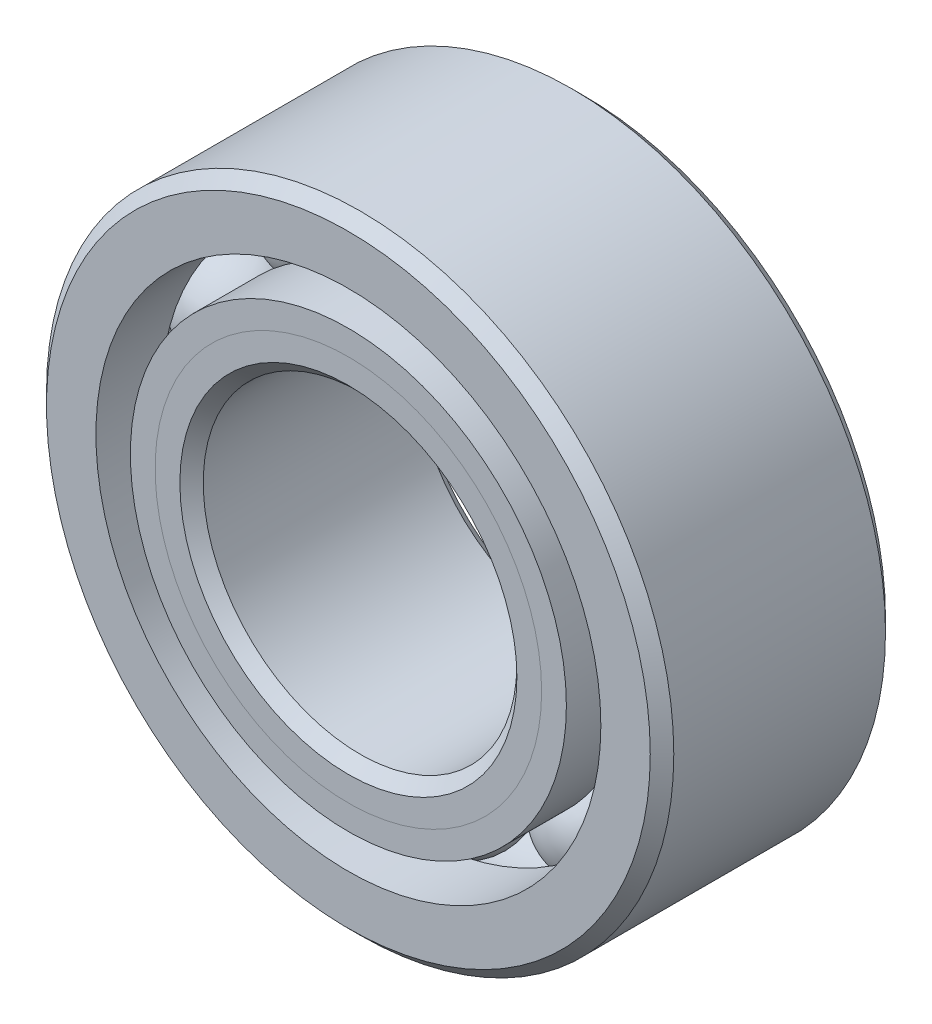
ISO-10303-21;
HEADER;
FILE_DESCRIPTION(('STEP AP214'),'2;1');
FILE_NAME('part.step','',(''),(''),'','','');
FILE_SCHEMA(('AUTOMOTIVE_DESIGN { 1 0 10303 214 1 1 1 1 }'));
ENDSEC;
DATA;
#1=APPLICATION_CONTEXT('core data for automotive mechanical design processes');
#2=APPLICATION_PROTOCOL_DEFINITION('international standard','automotive_design',2000,#1);
#3=PRODUCT_CONTEXT('',#1,'mechanical');
#4=PRODUCT('Part','Part','',(#3));
#5=PRODUCT_RELATED_PRODUCT_CATEGORY('part','',(#4));
#6=PRODUCT_DEFINITION_FORMATION('','',#4);
#7=PRODUCT_DEFINITION_CONTEXT('part definition',#1,'design');
#8=PRODUCT_DEFINITION('design','',#6,#7);
#9=PRODUCT_DEFINITION_SHAPE('','',#8);
#10=(LENGTH_UNIT() NAMED_UNIT(*) SI_UNIT(.MILLI.,.METRE.));
#11=(NAMED_UNIT(*) PLANE_ANGLE_UNIT() SI_UNIT($,.RADIAN.));
#12=(NAMED_UNIT(*) SI_UNIT($,.STERADIAN.) SOLID_ANGLE_UNIT());
#13=UNCERTAINTY_MEASURE_WITH_UNIT(LENGTH_MEASURE(1.E-05),#10,'distance_accuracy_value','');
#14=(GEOMETRIC_REPRESENTATION_CONTEXT(3) GLOBAL_UNCERTAINTY_ASSIGNED_CONTEXT((#13)) GLOBAL_UNIT_ASSIGNED_CONTEXT((#10,
#11,#12)) REPRESENTATION_CONTEXT('',''));
#15=CARTESIAN_POINT('',(0.,0.,0.));
#16=DIRECTION('',(0.,0.,1.));
#17=DIRECTION('',(1.,0.,0.));
#18=AXIS2_PLACEMENT_3D('',#15,#16,#17);
#19=CARTESIAN_POINT('',(-1.39966363202143,1.92647171785536,0.));
#20=DIRECTION('',(0.,0.,1.));
#21=DIRECTION('',(-0.587785252292462,0.809016994374955,0.));
#22=AXIS2_PLACEMENT_3D('',#19,#20,#21);
#23=SPHERICAL_SURFACE('',#22,0.557180720515983);
#24=CARTESIAN_POINT('',(-1.39966363202143,1.92647171785536,0.557180720515983));
#25=VERTEX_POINT('',#24);
#26=VERTEX_LOOP('',#25);
#27=FACE_BOUND('',#26,.T.);
#28=ADVANCED_FACE('F37',(#27),#23,.T.);
#29=CLOSED_SHELL('',(#28));
#30=MANIFOLD_SOLID_BREP('B2',#29);
#31=CARTESIAN_POINT('',(-2.26470332942783,0.735846717855369,0.));
#32=DIRECTION('',(0.,0.,1.));
#33=DIRECTION('',(-0.95105651629515,0.309016994374958,0.));
#34=AXIS2_PLACEMENT_3D('',#31,#32,#33);
#35=SPHERICAL_SURFACE('',#34,0.557180720515983);
#36=CARTESIAN_POINT('',(-2.26470332942783,0.735846717855369,0.557180720515983));
#37=VERTEX_POINT('',#36);
#38=VERTEX_LOOP('',#37);
#39=FACE_BOUND('',#38,.T.);
#40=ADVANCED_FACE('F68',(#39),#35,.T.);
#41=CLOSED_SHELL('',(#40));
#42=MANIFOLD_SOLID_BREP('B6',#41);
#43=CARTESIAN_POINT('',(-2.26470332942784,-0.735846717855322,0.));
#44=DIRECTION('',(0.,0.,1.));
#45=DIRECTION('',(-0.951056516295157,-0.309016994374938,0.));
#46=AXIS2_PLACEMENT_3D('',#43,#44,#45);
#47=SPHERICAL_SURFACE('',#46,0.557180720515983);
#48=CARTESIAN_POINT('',(-2.26470332942784,-0.735846717855322,0.557180720515983));
#49=VERTEX_POINT('',#48);
#50=VERTEX_LOOP('',#49);
#51=FACE_BOUND('',#50,.T.);
#52=ADVANCED_FACE('F99',(#51),#47,.T.);
#53=CLOSED_SHELL('',(#52));
#54=MANIFOLD_SOLID_BREP('B33',#53);
#55=CARTESIAN_POINT('',(-1.39966363202147,-1.92647171785533,0.));
#56=DIRECTION('',(0.,0.,1.));
#57=DIRECTION('',(-0.58778525229248,-0.809016994374942,0.));
#58=AXIS2_PLACEMENT_3D('',#55,#56,#57);
#59=SPHERICAL_SURFACE('',#58,0.557180720515983);
#60=CARTESIAN_POINT('',(-1.39966363202147,-1.92647171785533,0.557180720515983));
#61=VERTEX_POINT('',#60);
#62=VERTEX_LOOP('',#61);
#63=FACE_BOUND('',#62,.T.);
#64=ADVANCED_FACE('F130',(#63),#59,.T.);
#65=CLOSED_SHELL('',(#64));
#66=MANIFOLD_SOLID_BREP('B64',#65);
#67=CARTESIAN_POINT('',(0.,-2.38125,0.));
#68=DIRECTION('',(0.,0.,1.));
#69=DIRECTION('',(0.,-1.,0.));
#70=AXIS2_PLACEMENT_3D('',#67,#68,#69);
#71=SPHERICAL_SURFACE('',#70,0.557180720515983);
#72=CARTESIAN_POINT('',(0.,-2.38125,0.557180720515983));
#73=VERTEX_POINT('',#72);
#74=VERTEX_LOOP('',#73);
#75=FACE_BOUND('',#74,.T.);
#76=ADVANCED_FACE('F161',(#75),#71,.T.);
#77=CLOSED_SHELL('',(#76));
#78=MANIFOLD_SOLID_BREP('B95',#77);
#79=CARTESIAN_POINT('',(1.39966363202144,-1.92647171785535,0.));
#80=DIRECTION('',(0.,0.,1.));
#81=DIRECTION('',(0.587785252292469,-0.809016994374951,0.));
#82=AXIS2_PLACEMENT_3D('',#79,#80,#81);
#83=SPHERICAL_SURFACE('',#82,0.557180720515983);
#84=CARTESIAN_POINT('',(1.39966363202144,-1.92647171785535,0.557180720515983));
#85=VERTEX_POINT('',#84);
#86=VERTEX_LOOP('',#85);
#87=FACE_BOUND('',#86,.T.);
#88=ADVANCED_FACE('F192',(#87),#83,.T.);
#89=CLOSED_SHELL('',(#88));
#90=MANIFOLD_SOLID_BREP('B126',#89);
#91=CARTESIAN_POINT('',(2.26470332942783,-0.735846717855353,0.));
#92=DIRECTION('',(0.,0.,1.));
#93=DIRECTION('',(0.951056516295152,-0.309016994374952,0.));
#94=AXIS2_PLACEMENT_3D('',#91,#92,#93);
#95=SPHERICAL_SURFACE('',#94,0.557180720515983);
#96=CARTESIAN_POINT('',(2.26470332942783,-0.735846717855353,0.557180720515983));
#97=VERTEX_POINT('',#96);
#98=VERTEX_LOOP('',#97);
#99=FACE_BOUND('',#98,.T.);
#100=ADVANCED_FACE('F223',(#99),#95,.T.);
#101=CLOSED_SHELL('',(#100));
#102=MANIFOLD_SOLID_BREP('B157',#101);
#103=CARTESIAN_POINT('',(2.26470332942784,0.735846717855337,0.));
#104=DIRECTION('',(0.,0.,1.));
#105=DIRECTION('',(0.951056516295155,0.309016994374945,0.));
#106=AXIS2_PLACEMENT_3D('',#103,#104,#105);
#107=SPHERICAL_SURFACE('',#106,0.557180720515983);
#108=CARTESIAN_POINT('',(2.26470332942784,0.735846717855337,0.557180720515983));
#109=VERTEX_POINT('',#108);
#110=VERTEX_LOOP('',#109);
#111=FACE_BOUND('',#110,.T.);
#112=ADVANCED_FACE('F254',(#111),#107,.T.);
#113=CLOSED_SHELL('',(#112));
#114=MANIFOLD_SOLID_BREP('B188',#113);
#115=CARTESIAN_POINT('',(1.39966363202145,1.92647171785534,0.));
#116=DIRECTION('',(0.,0.,1.));
#117=DIRECTION('',(0.587785252292474,0.809016994374947,0.));
#118=AXIS2_PLACEMENT_3D('',#115,#116,#117);
#119=SPHERICAL_SURFACE('',#118,0.557180720515983);
#120=CARTESIAN_POINT('',(1.39966363202145,1.92647171785534,0.557180720515983));
#121=VERTEX_POINT('',#120);
#122=VERTEX_LOOP('',#121);
#123=FACE_BOUND('',#122,.T.);
#124=ADVANCED_FACE('F285',(#123),#119,.T.);
#125=CLOSED_SHELL('',(#124));
#126=MANIFOLD_SOLID_BREP('B219',#125);
#127=CARTESIAN_POINT('',(0.,2.38125,0.));
#128=DIRECTION('',(0.,0.,1.));
#129=DIRECTION('',(0.,1.,0.));
#130=AXIS2_PLACEMENT_3D('',#127,#128,#129);
#131=SPHERICAL_SURFACE('',#130,0.557180720515983);
#132=CARTESIAN_POINT('',(0.,2.38125,0.557180720515983));
#133=VERTEX_POINT('',#132);
#134=VERTEX_LOOP('',#133);
#135=FACE_BOUND('',#134,.T.);
#136=ADVANCED_FACE('F318',(#135),#131,.T.);
#137=CLOSED_SHELL('',(#136));
#138=MANIFOLD_SOLID_BREP('B250',#137);
#139=CARTESIAN_POINT('',(0.,1.95629204514573,1.190625));
#140=DIRECTION('',(0.,0.,-1.));
#141=DIRECTION('',(-1.,0.,0.));
#142=AXIS2_PLACEMENT_3D('',#139,#140,#141);
#143=PLANE('',#142);
#144=CARTESIAN_POINT('',(0.,0.,1.190625));
#145=DIRECTION('',(0.,0.,1.));
#146=DIRECTION('',(1.,0.,0.));
#147=AXIS2_PLACEMENT_3D('',#144,#145,#146);
#148=CIRCLE('',#147,1.70578463974201);
#149=CARTESIAN_POINT('',(1.70578463974201,0.,1.190625));
#150=VERTEX_POINT('',#149);
#151=EDGE_CURVE('E372',#150,#150,#148,.T.);
#152=ORIENTED_EDGE('',*,*,#151,.F.);
#153=EDGE_LOOP('',(#152));
#154=FACE_BOUND('',#153,.T.);
#155=CARTESIAN_POINT('',(0.,0.,1.190625));
#156=DIRECTION('',(0.,0.,1.));
#157=DIRECTION('',(1.,0.,0.));
#158=AXIS2_PLACEMENT_3D('',#155,#156,#157);
#159=CIRCLE('',#158,1.95629204514573);
#160=CARTESIAN_POINT('',(1.95629204514573,0.,1.190625));
#161=VERTEX_POINT('',#160);
#162=EDGE_CURVE('E317',#161,#161,#159,.T.);
#163=ORIENTED_EDGE('',*,*,#162,.T.);
#164=EDGE_LOOP('',(#163));
#165=FACE_BOUND('',#164,.T.);
#166=ADVANCED_FACE('F338',(#154,#165),#143,.F.);
#167=CARTESIAN_POINT('',(0.,0.,0.94011759459628));
#168=DIRECTION('',(0.,0.,1.));
#169=DIRECTION('',(1.,0.,0.));
#170=AXIS2_PLACEMENT_3D('',#167,#168,#169);
#171=CONICAL_SURFACE('',#170,1.70578463974201,0.78539816339745);
#172=ORIENTED_EDGE('',*,*,#162,.F.);
#173=EDGE_LOOP('',(#172));
#174=FACE_BOUND('',#173,.T.);
#175=CARTESIAN_POINT('',(0.,0.,0.94011759459628));
#176=DIRECTION('',(0.,0.,1.));
#177=DIRECTION('',(1.,0.,0.));
#178=AXIS2_PLACEMENT_3D('',#175,#176,#177);
#179=CIRCLE('',#178,1.70578463974201);
#180=CARTESIAN_POINT('',(1.70578463974201,0.,0.94011759459628));
#181=VERTEX_POINT('',#180);
#182=EDGE_CURVE('E344',#181,#181,#179,.T.);
#183=ORIENTED_EDGE('',*,*,#182,.T.);
#184=EDGE_LOOP('',(#183));
#185=FACE_BOUND('',#184,.T.);
#186=ADVANCED_FACE('F379',(#174,#185),#171,.T.);
#187=CARTESIAN_POINT('',(0.,0.,1.190625));
#188=DIRECTION('',(0.,0.,1.));
#189=DIRECTION('',(1.,0.,0.));
#190=AXIS2_PLACEMENT_3D('',#187,#188,#189);
#191=CYLINDRICAL_SURFACE('',#190,1.70578463974201);
#192=ORIENTED_EDGE('',*,*,#182,.F.);
#193=EDGE_LOOP('',(#192));
#194=FACE_BOUND('',#193,.T.);
#195=CARTESIAN_POINT('',(0.,0.,0.));
#196=DIRECTION('',(0.,0.,1.));
#197=DIRECTION('',(1.,0.,0.));
#198=AXIS2_PLACEMENT_3D('',#195,#196,#197);
#199=CIRCLE('',#198,1.70578463974201);
#200=CARTESIAN_POINT('',(1.70578463974201,0.,0.));
#201=VERTEX_POINT('',#200);
#202=EDGE_CURVE('E348',#201,#201,#199,.T.);
#203=ORIENTED_EDGE('',*,*,#202,.T.);
#204=EDGE_LOOP('',(#203));
#205=FACE_BOUND('',#204,.T.);
#206=ADVANCED_FACE('F383',(#194,#205),#191,.T.);
#207=CARTESIAN_POINT('',(0.,1.70578463974201,0.));
#208=DIRECTION('',(0.,0.,-1.));
#209=DIRECTION('',(-1.,0.,0.));
#210=AXIS2_PLACEMENT_3D('',#207,#208,#209);
#211=PLANE('',#210);
#212=ORIENTED_EDGE('',*,*,#202,.F.);
#213=EDGE_LOOP('',(#212));
#214=FACE_BOUND('',#213,.T.);
#215=CARTESIAN_POINT('',(0.,0.,0.));
#216=DIRECTION('',(0.,0.,1.));
#217=DIRECTION('',(1.,0.,0.));
#218=AXIS2_PLACEMENT_3D('',#215,#216,#217);
#219=CIRCLE('',#218,1.82406927948402);
#220=CARTESIAN_POINT('',(1.82406927948402,0.,0.));
#221=VERTEX_POINT('',#220);
#222=EDGE_CURVE('E352',#221,#221,#219,.T.);
#223=ORIENTED_EDGE('',*,*,#222,.T.);
#224=EDGE_LOOP('',(#223));
#225=FACE_BOUND('',#224,.T.);
#226=ADVANCED_FACE('F388',(#214,#225),#211,.F.);
#227=CARTESIAN_POINT('',(0.,0.,0.));
#228=DIRECTION('',(0.,0.,1.));
#229=DIRECTION('',(1.,0.,0.));
#230=AXIS2_PLACEMENT_3D('',#227,#228,#229);
#231=TOROIDAL_SURFACE('',#230,2.38125,0.557180720515983);
#232=ORIENTED_EDGE('',*,*,#222,.F.);
#233=EDGE_LOOP('',(#232));
#234=FACE_BOUND('',#233,.T.);
#235=CARTESIAN_POINT('',(0.,0.,-0.529166666666667));
#236=DIRECTION('',(0.,0.,1.));
#237=DIRECTION('',(1.,0.,0.));
#238=AXIS2_PLACEMENT_3D('',#235,#236,#237);
#239=CIRCLE('',#238,2.20679945054945);
#240=CARTESIAN_POINT('',(2.20679945054945,0.,-0.529166666666667));
#241=VERTEX_POINT('',#240);
#242=EDGE_CURVE('E357',#241,#241,#239,.T.);
#243=ORIENTED_EDGE('',*,*,#242,.T.);
#244=EDGE_LOOP('',(#243));
#245=FACE_BOUND('',#244,.T.);
#246=ADVANCED_FACE('F394',(#234,#245),#231,.F.);
#247=CARTESIAN_POINT('',(0.,0.,1.190625));
#248=DIRECTION('',(0.,0.,1.));
#249=DIRECTION('',(1.,0.,0.));
#250=AXIS2_PLACEMENT_3D('',#247,#248,#249);
#251=CYLINDRICAL_SURFACE('',#250,2.20679945054945);
#252=ORIENTED_EDGE('',*,*,#242,.F.);
#253=EDGE_LOOP('',(#252));
#254=FACE_BOUND('',#253,.T.);
#255=CARTESIAN_POINT('',(0.,0.,-1.190625));
#256=DIRECTION('',(0.,0.,1.));
#257=DIRECTION('',(1.,0.,0.));
#258=AXIS2_PLACEMENT_3D('',#255,#256,#257);
#259=CIRCLE('',#258,2.20679945054945);
#260=CARTESIAN_POINT('',(2.20679945054945,0.,-1.190625));
#261=VERTEX_POINT('',#260);
#262=EDGE_CURVE('E360',#261,#261,#259,.T.);
#263=ORIENTED_EDGE('',*,*,#262,.T.);
#264=EDGE_LOOP('',(#263));
#265=FACE_BOUND('',#264,.T.);
#266=ADVANCED_FACE('F398',(#254,#265),#251,.T.);
#267=CARTESIAN_POINT('',(0.,1.7065625,-1.190625));
#268=DIRECTION('',(0.,0.,1.));
#269=DIRECTION('',(1.,0.,0.));
#270=AXIS2_PLACEMENT_3D('',#267,#268,#269);
#271=PLANE('',#270);
#272=ORIENTED_EDGE('',*,*,#262,.F.);
#273=EDGE_LOOP('',(#272));
#274=FACE_BOUND('',#273,.T.);
#275=CARTESIAN_POINT('',(0.,0.,-1.190625));
#276=DIRECTION('',(0.,0.,1.));
#277=DIRECTION('',(1.,0.,0.));
#278=AXIS2_PLACEMENT_3D('',#275,#276,#277);
#279=CIRCLE('',#278,1.7065625);
#280=CARTESIAN_POINT('',(1.7065625,0.,-1.190625));
#281=VERTEX_POINT('',#280);
#282=EDGE_CURVE('E363',#281,#281,#279,.T.);
#283=ORIENTED_EDGE('',*,*,#282,.T.);
#284=EDGE_LOOP('',(#283));
#285=FACE_BOUND('',#284,.T.);
#286=ADVANCED_FACE('F402',(#274,#285),#271,.F.);
#287=CARTESIAN_POINT('',(0.,0.,-1.0715625));
#288=DIRECTION('',(0.,0.,-1.));
#289=DIRECTION('',(-1.,0.,0.));
#290=AXIS2_PLACEMENT_3D('',#287,#288,#289);
#291=CONICAL_SURFACE('',#290,1.5875,0.785398163397447);
#292=ORIENTED_EDGE('',*,*,#282,.F.);
#293=EDGE_LOOP('',(#292));
#294=FACE_BOUND('',#293,.T.);
#295=CARTESIAN_POINT('',(0.,0.,-1.0715625));
#296=DIRECTION('',(0.,0.,1.));
#297=DIRECTION('',(1.,0.,0.));
#298=AXIS2_PLACEMENT_3D('',#295,#296,#297);
#299=CIRCLE('',#298,1.5875);
#300=CARTESIAN_POINT('',(1.5875,0.,-1.0715625));
#301=VERTEX_POINT('',#300);
#302=EDGE_CURVE('E366',#301,#301,#299,.T.);
#303=ORIENTED_EDGE('',*,*,#302,.T.);
#304=EDGE_LOOP('',(#303));
#305=FACE_BOUND('',#304,.T.);
#306=ADVANCED_FACE('F406',(#294,#305),#291,.F.);
#307=CARTESIAN_POINT('',(0.,0.,1.190625));
#308=DIRECTION('',(0.,0.,1.));
#309=DIRECTION('',(1.,0.,0.));
#310=AXIS2_PLACEMENT_3D('',#307,#308,#309);
#311=CYLINDRICAL_SURFACE('',#310,1.5875);
#312=ORIENTED_EDGE('',*,*,#302,.F.);
#313=EDGE_LOOP('',(#312));
#314=FACE_BOUND('',#313,.T.);
#315=CARTESIAN_POINT('',(0.,0.,1.07234036025799));
#316=DIRECTION('',(0.,0.,1.));
#317=DIRECTION('',(1.,0.,0.));
#318=AXIS2_PLACEMENT_3D('',#315,#316,#317);
#319=CIRCLE('',#318,1.5875);
#320=CARTESIAN_POINT('',(1.5875,0.,1.07234036025799));
#321=VERTEX_POINT('',#320);
#322=EDGE_CURVE('E369',#321,#321,#319,.T.);
#323=ORIENTED_EDGE('',*,*,#322,.T.);
#324=EDGE_LOOP('',(#323));
#325=FACE_BOUND('',#324,.T.);
#326=ADVANCED_FACE('F410',(#314,#325),#311,.F.);
#327=CARTESIAN_POINT('',(0.,0.,1.190625));
#328=DIRECTION('',(0.,0.,1.));
#329=DIRECTION('',(1.,0.,0.));
#330=AXIS2_PLACEMENT_3D('',#327,#328,#329);
#331=CONICAL_SURFACE('',#330,1.70578463974201,0.78539816339745);
#332=ORIENTED_EDGE('',*,*,#322,.F.);
#333=EDGE_LOOP('',(#332));
#334=FACE_BOUND('',#333,.T.);
#335=ORIENTED_EDGE('',*,*,#151,.T.);
#336=EDGE_LOOP('',(#335));
#337=FACE_BOUND('',#336,.T.);
#338=ADVANCED_FACE('F376',(#334,#337),#331,.F.);
#339=CLOSED_SHELL('',(#166,#186,#206,#226,#246,#266,#286,#306,#326,#338));
#340=MANIFOLD_SOLID_BREP('B281',#339);
#341=CARTESIAN_POINT('',(0.,2.20679945054945,1.190625));
#342=DIRECTION('',(0.,0.,-1.));
#343=DIRECTION('',(-1.,0.,0.));
#344=AXIS2_PLACEMENT_3D('',#341,#342,#343);
#345=PLANE('',#344);
#346=CARTESIAN_POINT('',(0.,0.,1.190625));
#347=DIRECTION('',(0.,0.,1.));
#348=DIRECTION('',(1.,0.,0.));
#349=AXIS2_PLACEMENT_3D('',#346,#347,#348);
#350=CIRCLE('',#349,1.95629204514573);
#351=CARTESIAN_POINT('',(1.95629204514573,0.,1.190625));
#352=VERTEX_POINT('',#351);
#353=EDGE_CURVE('E337',#352,#352,#350,.T.);
#354=ORIENTED_EDGE('',*,*,#353,.F.);
#355=EDGE_LOOP('',(#354));
#356=FACE_BOUND('',#355,.T.);
#357=CARTESIAN_POINT('',(0.,0.,1.190625));
#358=DIRECTION('',(0.,0.,1.));
#359=DIRECTION('',(1.,0.,0.));
#360=AXIS2_PLACEMENT_3D('',#357,#358,#359);
#361=CIRCLE('',#360,2.20679945054945);
#362=CARTESIAN_POINT('',(2.20679945054945,0.,1.190625));
#363=VERTEX_POINT('',#362);
#364=EDGE_CURVE('E518',#363,#363,#361,.T.);
#365=ORIENTED_EDGE('',*,*,#364,.T.);
#366=EDGE_LOOP('',(#365));
#367=FACE_BOUND('',#366,.T.);
#368=ADVANCED_FACE('F496',(#356,#367),#345,.F.);
#369=CARTESIAN_POINT('',(0.,0.,1.190625));
#370=DIRECTION('',(0.,0.,1.));
#371=DIRECTION('',(1.,0.,0.));
#372=AXIS2_PLACEMENT_3D('',#369,#370,#371);
#373=CONICAL_SURFACE('',#372,1.95629204514573,0.78539816339745);
#374=CARTESIAN_POINT('',(0.,0.,0.94011759459628));
#375=DIRECTION('',(0.,0.,1.));
#376=DIRECTION('',(1.,0.,0.));
#377=AXIS2_PLACEMENT_3D('',#374,#375,#376);
#378=CIRCLE('',#377,1.70578463974201);
#379=CARTESIAN_POINT('',(1.70578463974201,0.,0.94011759459628));
#380=VERTEX_POINT('',#379);
#381=EDGE_CURVE('E502',#380,#380,#378,.T.);
#382=ORIENTED_EDGE('',*,*,#381,.F.);
#383=EDGE_LOOP('',(#382));
#384=FACE_BOUND('',#383,.T.);
#385=ORIENTED_EDGE('',*,*,#353,.T.);
#386=EDGE_LOOP('',(#385));
#387=FACE_BOUND('',#386,.T.);
#388=ADVANCED_FACE('F543',(#384,#387),#373,.F.);
#389=CARTESIAN_POINT('',(0.,0.,1.190625));
#390=DIRECTION('',(0.,0.,1.));
#391=DIRECTION('',(1.,0.,0.));
#392=AXIS2_PLACEMENT_3D('',#389,#390,#391);
#393=CYLINDRICAL_SURFACE('',#392,1.70578463974201);
#394=CARTESIAN_POINT('',(0.,0.,0.));
#395=DIRECTION('',(0.,0.,1.));
#396=DIRECTION('',(1.,0.,0.));
#397=AXIS2_PLACEMENT_3D('',#394,#395,#396);
#398=CIRCLE('',#397,1.70578463974201);
#399=CARTESIAN_POINT('',(1.70578463974201,0.,0.));
#400=VERTEX_POINT('',#399);
#401=EDGE_CURVE('E506',#400,#400,#398,.T.);
#402=ORIENTED_EDGE('',*,*,#401,.F.);
#403=EDGE_LOOP('',(#402));
#404=FACE_BOUND('',#403,.T.);
#405=ORIENTED_EDGE('',*,*,#381,.T.);
#406=EDGE_LOOP('',(#405));
#407=FACE_BOUND('',#406,.T.);
#408=ADVANCED_FACE('F538',(#404,#407),#393,.F.);
#409=CARTESIAN_POINT('',(0.,1.70578463974201,0.));
#410=DIRECTION('',(0.,0.,1.));
#411=DIRECTION('',(1.,0.,0.));
#412=AXIS2_PLACEMENT_3D('',#409,#410,#411);
#413=PLANE('',#412);
#414=CARTESIAN_POINT('',(0.,0.,0.));
#415=DIRECTION('',(0.,0.,1.));
#416=DIRECTION('',(1.,0.,0.));
#417=AXIS2_PLACEMENT_3D('',#414,#415,#416);
#418=CIRCLE('',#417,1.82406927948402);
#419=CARTESIAN_POINT('',(1.82406927948402,0.,0.));
#420=VERTEX_POINT('',#419);
#421=EDGE_CURVE('E510',#420,#420,#418,.T.);
#422=ORIENTED_EDGE('',*,*,#421,.F.);
#423=EDGE_LOOP('',(#422));
#424=FACE_BOUND('',#423,.T.);
#425=ORIENTED_EDGE('',*,*,#401,.T.);
#426=EDGE_LOOP('',(#425));
#427=FACE_BOUND('',#426,.T.);
#428=ADVANCED_FACE('F532',(#424,#427),#413,.F.);
#429=CARTESIAN_POINT('',(0.,0.,0.));
#430=DIRECTION('',(0.,0.,1.));
#431=DIRECTION('',(1.,0.,0.));
#432=AXIS2_PLACEMENT_3D('',#429,#430,#431);
#433=TOROIDAL_SURFACE('',#432,2.38125,0.557180720515983);
#434=CARTESIAN_POINT('',(0.,0.,0.529166666666667));
#435=DIRECTION('',(0.,0.,1.));
#436=DIRECTION('',(1.,0.,0.));
#437=AXIS2_PLACEMENT_3D('',#434,#435,#436);
#438=CIRCLE('',#437,2.20679945054945);
#439=CARTESIAN_POINT('',(2.20679945054945,0.,0.529166666666667));
#440=VERTEX_POINT('',#439);
#441=EDGE_CURVE('E515',#440,#440,#438,.T.);
#442=ORIENTED_EDGE('',*,*,#441,.F.);
#443=EDGE_LOOP('',(#442));
#444=FACE_BOUND('',#443,.T.);
#445=ORIENTED_EDGE('',*,*,#421,.T.);
#446=EDGE_LOOP('',(#445));
#447=FACE_BOUND('',#446,.T.);
#448=ADVANCED_FACE('F526',(#444,#447),#433,.F.);
#449=CARTESIAN_POINT('',(0.,0.,1.190625));
#450=DIRECTION('',(0.,0.,1.));
#451=DIRECTION('',(1.,0.,0.));
#452=AXIS2_PLACEMENT_3D('',#449,#450,#451);
#453=CYLINDRICAL_SURFACE('',#452,2.20679945054945);
#454=ORIENTED_EDGE('',*,*,#364,.F.);
#455=EDGE_LOOP('',(#454));
#456=FACE_BOUND('',#455,.T.);
#457=ORIENTED_EDGE('',*,*,#441,.T.);
#458=EDGE_LOOP('',(#457));
#459=FACE_BOUND('',#458,.T.);
#460=ADVANCED_FACE('F523',(#456,#459),#453,.T.);
#461=CLOSED_SHELL('',(#368,#388,#408,#428,#448,#460));
#462=MANIFOLD_SOLID_BREP('B312',#461);
#463=CARTESIAN_POINT('',(0.,0.,1.0715625));
#464=DIRECTION('',(0.,0.,-1.));
#465=DIRECTION('',(-1.,0.,0.));
#466=AXIS2_PLACEMENT_3D('',#463,#464,#465);
#467=CONICAL_SURFACE('',#466,3.175,0.785398163397449);
#468=CARTESIAN_POINT('',(0.,0.,1.190625));
#469=DIRECTION('',(0.,0.,1.));
#470=DIRECTION('',(1.,0.,0.));
#471=AXIS2_PLACEMENT_3D('',#468,#469,#470);
#472=CIRCLE('',#471,3.0559375);
#473=CARTESIAN_POINT('',(3.0559375,0.,1.190625));
#474=VERTEX_POINT('',#473);
#475=EDGE_CURVE('E615',#474,#474,#472,.T.);
#476=ORIENTED_EDGE('',*,*,#475,.F.);
#477=EDGE_LOOP('',(#476));
#478=FACE_BOUND('',#477,.T.);
#479=CARTESIAN_POINT('',(0.,0.,1.0715625));
#480=DIRECTION('',(0.,0.,1.));
#481=DIRECTION('',(1.,0.,0.));
#482=AXIS2_PLACEMENT_3D('',#479,#480,#481);
#483=CIRCLE('',#482,3.175);
#484=CARTESIAN_POINT('',(3.175,0.,1.0715625));
#485=VERTEX_POINT('',#484);
#486=EDGE_CURVE('E495',#485,#485,#483,.T.);
#487=ORIENTED_EDGE('',*,*,#486,.T.);
#488=EDGE_LOOP('',(#487));
#489=FACE_BOUND('',#488,.T.);
#490=ADVANCED_FACE('F587',(#478,#489),#467,.T.);
#491=CARTESIAN_POINT('',(0.,0.,1.190625));
#492=DIRECTION('',(0.,0.,1.));
#493=DIRECTION('',(1.,0.,0.));
#494=AXIS2_PLACEMENT_3D('',#491,#492,#493);
#495=CYLINDRICAL_SURFACE('',#494,3.175);
#496=ORIENTED_EDGE('',*,*,#486,.F.);
#497=EDGE_LOOP('',(#496));
#498=FACE_BOUND('',#497,.T.);
#499=CARTESIAN_POINT('',(0.,0.,-1.0715625));
#500=DIRECTION('',(0.,0.,1.));
#501=DIRECTION('',(1.,0.,0.));
#502=AXIS2_PLACEMENT_3D('',#499,#500,#501);
#503=CIRCLE('',#502,3.175);
#504=CARTESIAN_POINT('',(3.175,0.,-1.0715625));
#505=VERTEX_POINT('',#504);
#506=EDGE_CURVE('E593',#505,#505,#503,.T.);
#507=ORIENTED_EDGE('',*,*,#506,.T.);
#508=EDGE_LOOP('',(#507));
#509=FACE_BOUND('',#508,.T.);
#510=ADVANCED_FACE('F622',(#498,#509),#495,.T.);
#511=CARTESIAN_POINT('',(0.,0.,-1.190625));
#512=DIRECTION('',(0.,0.,1.));
#513=DIRECTION('',(1.,0.,0.));
#514=AXIS2_PLACEMENT_3D('',#511,#512,#513);
#515=CONICAL_SURFACE('',#514,3.0559375,0.785398163397448);
#516=ORIENTED_EDGE('',*,*,#506,.F.);
#517=EDGE_LOOP('',(#516));
#518=FACE_BOUND('',#517,.T.);
#519=CARTESIAN_POINT('',(0.,0.,-1.190625));
#520=DIRECTION('',(0.,0.,1.));
#521=DIRECTION('',(1.,0.,0.));
#522=AXIS2_PLACEMENT_3D('',#519,#520,#521);
#523=CIRCLE('',#522,3.0559375);
#524=CARTESIAN_POINT('',(3.0559375,0.,-1.190625));
#525=VERTEX_POINT('',#524);
#526=EDGE_CURVE('E597',#525,#525,#523,.T.);
#527=ORIENTED_EDGE('',*,*,#526,.T.);
#528=EDGE_LOOP('',(#527));
#529=FACE_BOUND('',#528,.T.);
#530=ADVANCED_FACE('F626',(#518,#529),#515,.T.);
#531=CARTESIAN_POINT('',(0.,3.0559375,-1.190625));
#532=DIRECTION('',(0.,0.,1.));
#533=DIRECTION('',(1.,0.,0.));
#534=AXIS2_PLACEMENT_3D('',#531,#532,#533);
#535=PLANE('',#534);
#536=ORIENTED_EDGE('',*,*,#526,.F.);
#537=EDGE_LOOP('',(#536));
#538=FACE_BOUND('',#537,.T.);
#539=CARTESIAN_POINT('',(0.,0.,-1.190625));
#540=DIRECTION('',(0.,0.,1.));
#541=DIRECTION('',(1.,0.,0.));
#542=AXIS2_PLACEMENT_3D('',#539,#540,#541);
#543=CIRCLE('',#542,2.55570054945055);
#544=CARTESIAN_POINT('',(2.55570054945055,0.,-1.190625));
#545=VERTEX_POINT('',#544);
#546=EDGE_CURVE('E601',#545,#545,#543,.T.);
#547=ORIENTED_EDGE('',*,*,#546,.T.);
#548=EDGE_LOOP('',(#547));
#549=FACE_BOUND('',#548,.T.);
#550=ADVANCED_FACE('F631',(#538,#549),#535,.F.);
#551=CARTESIAN_POINT('',(0.,0.,1.190625));
#552=DIRECTION('',(0.,0.,1.));
#553=DIRECTION('',(1.,0.,0.));
#554=AXIS2_PLACEMENT_3D('',#551,#552,#553);
#555=CYLINDRICAL_SURFACE('',#554,2.55570054945055);
#556=ORIENTED_EDGE('',*,*,#546,.F.);
#557=EDGE_LOOP('',(#556));
#558=FACE_BOUND('',#557,.T.);
#559=CARTESIAN_POINT('',(0.,0.,-0.529166666666667));
#560=DIRECTION('',(0.,0.,1.));
#561=DIRECTION('',(1.,0.,0.));
#562=AXIS2_PLACEMENT_3D('',#559,#560,#561);
#563=CIRCLE('',#562,2.55570054945055);
#564=CARTESIAN_POINT('',(2.55570054945055,0.,-0.529166666666667));
#565=VERTEX_POINT('',#564);
#566=EDGE_CURVE('E606',#565,#565,#563,.T.);
#567=ORIENTED_EDGE('',*,*,#566,.T.);
#568=EDGE_LOOP('',(#567));
#569=FACE_BOUND('',#568,.T.);
#570=ADVANCED_FACE('F637',(#558,#569),#555,.F.);
#571=CARTESIAN_POINT('',(0.,0.,0.));
#572=DIRECTION('',(0.,0.,1.));
#573=DIRECTION('',(1.,0.,0.));
#574=AXIS2_PLACEMENT_3D('',#571,#572,#573);
#575=TOROIDAL_SURFACE('',#574,2.38125,0.557180720515983);
#576=ORIENTED_EDGE('',*,*,#566,.F.);
#577=EDGE_LOOP('',(#576));
#578=FACE_BOUND('',#577,.T.);
#579=CARTESIAN_POINT('',(0.,0.,0.529166666666667));
#580=DIRECTION('',(0.,0.,1.));
#581=DIRECTION('',(1.,0.,0.));
#582=AXIS2_PLACEMENT_3D('',#579,#580,#581);
#583=CIRCLE('',#582,2.55570054945055);
#584=CARTESIAN_POINT('',(2.55570054945055,0.,0.529166666666667));
#585=VERTEX_POINT('',#584);
#586=EDGE_CURVE('E609',#585,#585,#583,.T.);
#587=ORIENTED_EDGE('',*,*,#586,.T.);
#588=EDGE_LOOP('',(#587));
#589=FACE_BOUND('',#588,.T.);
#590=ADVANCED_FACE('F641',(#578,#589),#575,.F.);
#591=CARTESIAN_POINT('',(0.,0.,1.190625));
#592=DIRECTION('',(0.,0.,1.));
#593=DIRECTION('',(1.,0.,0.));
#594=AXIS2_PLACEMENT_3D('',#591,#592,#593);
#595=CYLINDRICAL_SURFACE('',#594,2.55570054945055);
#596=ORIENTED_EDGE('',*,*,#586,.F.);
#597=EDGE_LOOP('',(#596));
#598=FACE_BOUND('',#597,.T.);
#599=CARTESIAN_POINT('',(0.,0.,1.190625));
#600=DIRECTION('',(0.,0.,1.));
#601=DIRECTION('',(1.,0.,0.));
#602=AXIS2_PLACEMENT_3D('',#599,#600,#601);
#603=CIRCLE('',#602,2.55570054945055);
#604=CARTESIAN_POINT('',(2.55570054945055,0.,1.190625));
#605=VERTEX_POINT('',#604);
#606=EDGE_CURVE('E612',#605,#605,#603,.T.);
#607=ORIENTED_EDGE('',*,*,#606,.T.);
#608=EDGE_LOOP('',(#607));
#609=FACE_BOUND('',#608,.T.);
#610=ADVANCED_FACE('F645',(#598,#609),#595,.F.);
#611=CARTESIAN_POINT('',(0.,3.0559375,1.190625));
#612=DIRECTION('',(0.,0.,-1.));
#613=DIRECTION('',(-1.,0.,0.));
#614=AXIS2_PLACEMENT_3D('',#611,#612,#613);
#615=PLANE('',#614);
#616=ORIENTED_EDGE('',*,*,#606,.F.);
#617=EDGE_LOOP('',(#616));
#618=FACE_BOUND('',#617,.T.);
#619=ORIENTED_EDGE('',*,*,#475,.T.);
#620=EDGE_LOOP('',(#619));
#621=FACE_BOUND('',#620,.T.);
#622=ADVANCED_FACE('F619',(#618,#621),#615,.F.);
#623=CLOSED_SHELL('',(#490,#510,#530,#550,#570,#590,#610,#622));
#624=MANIFOLD_SOLID_BREP('B332',#623);
#625=ADVANCED_BREP_SHAPE_REPRESENTATION('',(#18,#30,#42,#54,#66,#78,#90,#102,#114,#126,#138,
#340,#462,#624),#14);
#626=SHAPE_DEFINITION_REPRESENTATION(#9,#625);
ENDSEC;
END-ISO-10303-21;
